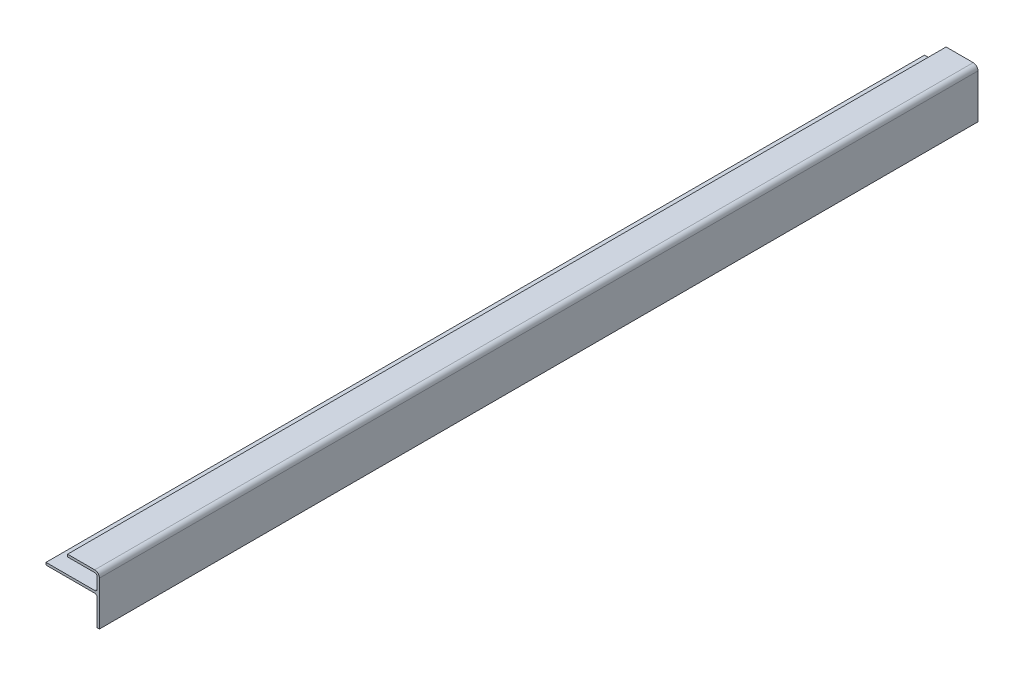
ISO-10303-21;
HEADER;
FILE_DESCRIPTION(('STEP AP214'),'2;1');
FILE_NAME('part.step','',(''),(''),'','','');
FILE_SCHEMA(('AUTOMOTIVE_DESIGN { 1 0 10303 214 1 1 1 1 }'));
ENDSEC;
DATA;
#1=APPLICATION_CONTEXT('core data for automotive mechanical design processes');
#2=APPLICATION_PROTOCOL_DEFINITION('international standard','automotive_design',2000,#1);
#3=PRODUCT_CONTEXT('',#1,'mechanical');
#4=PRODUCT('Part','Part','',(#3));
#5=PRODUCT_RELATED_PRODUCT_CATEGORY('part','',(#4));
#6=PRODUCT_DEFINITION_FORMATION('','',#4);
#7=PRODUCT_DEFINITION_CONTEXT('part definition',#1,'design');
#8=PRODUCT_DEFINITION('design','',#6,#7);
#9=PRODUCT_DEFINITION_SHAPE('','',#8);
#10=(LENGTH_UNIT() NAMED_UNIT(*) SI_UNIT(.MILLI.,.METRE.));
#11=(NAMED_UNIT(*) PLANE_ANGLE_UNIT() SI_UNIT($,.RADIAN.));
#12=(NAMED_UNIT(*) SI_UNIT($,.STERADIAN.) SOLID_ANGLE_UNIT());
#13=UNCERTAINTY_MEASURE_WITH_UNIT(LENGTH_MEASURE(1.E-05),#10,'distance_accuracy_value','');
#14=(GEOMETRIC_REPRESENTATION_CONTEXT(3) GLOBAL_UNCERTAINTY_ASSIGNED_CONTEXT((#13)) GLOBAL_UNIT_ASSIGNED_CONTEXT((#10,
#11,#12)) REPRESENTATION_CONTEXT('',''));
#15=CARTESIAN_POINT('',(0.,0.,0.));
#16=DIRECTION('',(0.,0.,1.));
#17=DIRECTION('',(1.,0.,0.));
#18=AXIS2_PLACEMENT_3D('',#15,#16,#17);
#19=CARTESIAN_POINT('',(1217.6125,36.5125,292.1));
#20=DIRECTION('',(0.,0.,-1.));
#21=DIRECTION('',(-1.,0.,0.));
#22=AXIS2_PLACEMENT_3D('',#19,#20,#21);
#23=CYLINDRICAL_SURFACE('',#22,1.58749999999993);
#24=CARTESIAN_POINT('',(1217.6125,36.5125,-292.1));
#25=DIRECTION('',(0.,0.,-1.));
#26=DIRECTION('',(1.,0.,0.));
#27=AXIS2_PLACEMENT_3D('',#24,#25,#26);
#28=CIRCLE('',#27,1.58749999999993);
#29=CARTESIAN_POINT('',(1217.6125,38.1,-292.1));
#30=VERTEX_POINT('',#29);
#31=CARTESIAN_POINT('',(1219.2,36.5125,-292.1));
#32=VERTEX_POINT('',#31);
#33=EDGE_CURVE('E163',#30,#32,#28,.T.);
#34=ORIENTED_EDGE('',*,*,#33,.T.);
#35=DIRECTION('',(0.,0.,-1.));
#36=VECTOR('',#35,1.);
#37=CARTESIAN_POINT('',(1219.2,36.5125,292.1));
#38=LINE('',#37,#36);
#39=CARTESIAN_POINT('',(1219.2,36.5125,292.1));
#40=VERTEX_POINT('',#39);
#41=EDGE_CURVE('E11',#40,#32,#38,.T.);
#42=ORIENTED_EDGE('',*,*,#41,.F.);
#43=CARTESIAN_POINT('',(1217.6125,36.5125,292.1));
#44=DIRECTION('',(0.,0.,-1.));
#45=DIRECTION('',(1.,0.,0.));
#46=AXIS2_PLACEMENT_3D('',#43,#44,#45);
#47=CIRCLE('',#46,1.58749999999993);
#48=CARTESIAN_POINT('',(1217.6125,38.1,292.1));
#49=VERTEX_POINT('',#48);
#50=EDGE_CURVE('E189',#49,#40,#47,.T.);
#51=ORIENTED_EDGE('',*,*,#50,.F.);
#52=DIRECTION('',(0.,0.,-1.));
#53=VECTOR('',#52,1.);
#54=CARTESIAN_POINT('',(1217.6125,38.1,292.1));
#55=LINE('',#54,#53);
#56=EDGE_CURVE('E159',#49,#30,#55,.T.);
#57=ORIENTED_EDGE('',*,*,#56,.T.);
#58=EDGE_LOOP('',(#34,#42,#51,#57));
#59=FACE_BOUND('',#58,.T.);
#60=ADVANCED_FACE('F31',(#59),#23,.F.);
#61=CARTESIAN_POINT('',(1219.2,19.05,292.1));
#62=DIRECTION('',(1.,0.,0.));
#63=DIRECTION('',(0.,0.,-1.));
#64=AXIS2_PLACEMENT_3D('',#61,#62,#63);
#65=PLANE('',#64);
#66=DIRECTION('',(0.,-1.,0.));
#67=VECTOR('',#66,1.);
#68=CARTESIAN_POINT('',(1219.2,19.05,-292.1));
#69=LINE('',#68,#67);
#70=CARTESIAN_POINT('',(1219.2,19.05,-292.1));
#71=VERTEX_POINT('',#70);
#72=EDGE_CURVE('E166',#32,#71,#69,.T.);
#73=ORIENTED_EDGE('',*,*,#72,.T.);
#74=DIRECTION('',(0.,0.,-1.));
#75=VECTOR('',#74,1.);
#76=CARTESIAN_POINT('',(1219.2,19.05,292.1));
#77=LINE('',#76,#75);
#78=CARTESIAN_POINT('',(1219.2,19.05,292.1));
#79=VERTEX_POINT('',#78);
#80=EDGE_CURVE('E39',#79,#71,#77,.T.);
#81=ORIENTED_EDGE('',*,*,#80,.F.);
#82=DIRECTION('',(0.,-1.,0.));
#83=VECTOR('',#82,1.);
#84=CARTESIAN_POINT('',(1219.2,19.05,292.1));
#85=LINE('',#84,#83);
#86=EDGE_CURVE('E108',#40,#79,#85,.T.);
#87=ORIENTED_EDGE('',*,*,#86,.F.);
#88=ORIENTED_EDGE('',*,*,#41,.T.);
#89=EDGE_LOOP('',(#73,#81,#87,#88));
#90=FACE_BOUND('',#89,.T.);
#91=ADVANCED_FACE('F277',(#90),#65,.F.);
#92=CARTESIAN_POINT('',(1219.2,19.05,292.1));
#93=DIRECTION('',(0.,1.,0.));
#94=DIRECTION('',(0.,0.,1.));
#95=AXIS2_PLACEMENT_3D('',#92,#93,#94);
#96=PLANE('',#95);
#97=DIRECTION('',(1.,0.,0.));
#98=VECTOR('',#97,1.);
#99=CARTESIAN_POINT('',(1219.2,19.05,-292.1));
#100=LINE('',#99,#98);
#101=CARTESIAN_POINT('',(1220.7875,19.05,-292.1));
#102=VERTEX_POINT('',#101);
#103=EDGE_CURVE('E168',#71,#102,#100,.T.);
#104=ORIENTED_EDGE('',*,*,#103,.T.);
#105=DIRECTION('',(0.,0.,-1.));
#106=VECTOR('',#105,1.);
#107=CARTESIAN_POINT('',(1220.7875,19.05,292.1));
#108=LINE('',#107,#106);
#109=CARTESIAN_POINT('',(1220.7875,19.05,292.1));
#110=VERTEX_POINT('',#109);
#111=EDGE_CURVE('E214',#110,#102,#108,.T.);
#112=ORIENTED_EDGE('',*,*,#111,.F.);
#113=DIRECTION('',(1.,0.,0.));
#114=VECTOR('',#113,1.);
#115=CARTESIAN_POINT('',(1219.2,19.05,292.1));
#116=LINE('',#115,#114);
#117=EDGE_CURVE('E222',#79,#110,#116,.T.);
#118=ORIENTED_EDGE('',*,*,#117,.F.);
#119=ORIENTED_EDGE('',*,*,#80,.T.);
#120=EDGE_LOOP('',(#104,#112,#118,#119));
#121=FACE_BOUND('',#120,.T.);
#122=ADVANCED_FACE('F220',(#121),#96,.F.);
#123=CARTESIAN_POINT('',(1220.7875,48.387,292.1));
#124=DIRECTION('',(-1.,0.,0.));
#125=DIRECTION('',(0.,0.,1.));
#126=AXIS2_PLACEMENT_3D('',#123,#124,#125);
#127=PLANE('',#126);
#128=DIRECTION('',(0.,1.,0.));
#129=VECTOR('',#128,1.);
#130=CARTESIAN_POINT('',(1220.7875,48.387,-292.1));
#131=LINE('',#130,#129);
#132=CARTESIAN_POINT('',(1220.7875,48.387,-292.1));
#133=VERTEX_POINT('',#132);
#134=EDGE_CURVE('E170',#102,#133,#131,.T.);
#135=ORIENTED_EDGE('',*,*,#134,.T.);
#136=DIRECTION('',(0.,0.,-1.));
#137=VECTOR('',#136,1.);
#138=CARTESIAN_POINT('',(1220.7875,48.387,292.1));
#139=LINE('',#138,#137);
#140=CARTESIAN_POINT('',(1220.7875,48.387,292.1));
#141=VERTEX_POINT('',#140);
#142=EDGE_CURVE('E211',#141,#133,#139,.T.);
#143=ORIENTED_EDGE('',*,*,#142,.F.);
#144=DIRECTION('',(0.,1.,0.));
#145=VECTOR('',#144,1.);
#146=CARTESIAN_POINT('',(1220.7875,48.387,292.1));
#147=LINE('',#146,#145);
#148=EDGE_CURVE('E240',#110,#141,#147,.T.);
#149=ORIENTED_EDGE('',*,*,#148,.F.);
#150=ORIENTED_EDGE('',*,*,#111,.T.);
#151=EDGE_LOOP('',(#135,#143,#149,#150));
#152=FACE_BOUND('',#151,.T.);
#153=ADVANCED_FACE('F231',(#152),#127,.F.);
#154=CARTESIAN_POINT('',(1217.6125,48.387,292.1));
#155=DIRECTION('',(0.,0.,-1.));
#156=DIRECTION('',(-1.,0.,0.));
#157=AXIS2_PLACEMENT_3D('',#154,#155,#156);
#158=CYLINDRICAL_SURFACE('',#157,3.17499999999997);
#159=CARTESIAN_POINT('',(1217.6125,48.387,-292.1));
#160=DIRECTION('',(0.,0.,1.));
#161=DIRECTION('',(1.,0.,0.));
#162=AXIS2_PLACEMENT_3D('',#159,#160,#161);
#163=CIRCLE('',#162,3.17499999999997);
#164=CARTESIAN_POINT('',(1217.6125,51.562,-292.1));
#165=VERTEX_POINT('',#164);
#166=EDGE_CURVE('E172',#133,#165,#163,.T.);
#167=ORIENTED_EDGE('',*,*,#166,.T.);
#168=DIRECTION('',(0.,0.,-1.));
#169=VECTOR('',#168,1.);
#170=CARTESIAN_POINT('',(1217.6125,51.562,292.1));
#171=LINE('',#170,#169);
#172=CARTESIAN_POINT('',(1217.6125,51.562,292.1));
#173=VERTEX_POINT('',#172);
#174=EDGE_CURVE('E208',#173,#165,#171,.T.);
#175=ORIENTED_EDGE('',*,*,#174,.F.);
#176=CARTESIAN_POINT('',(1217.6125,48.387,292.1));
#177=DIRECTION('',(0.,0.,1.));
#178=DIRECTION('',(1.,0.,0.));
#179=AXIS2_PLACEMENT_3D('',#176,#177,#178);
#180=CIRCLE('',#179,3.17499999999997);
#181=EDGE_CURVE('E237',#141,#173,#180,.T.);
#182=ORIENTED_EDGE('',*,*,#181,.F.);
#183=ORIENTED_EDGE('',*,*,#142,.T.);
#184=EDGE_LOOP('',(#167,#175,#182,#183));
#185=FACE_BOUND('',#184,.T.);
#186=ADVANCED_FACE('F235',(#185),#158,.T.);
#187=CARTESIAN_POINT('',(1217.6125,51.562,292.1));
#188=DIRECTION('',(0.,-1.,0.));
#189=DIRECTION('',(1.,0.,0.));
#190=AXIS2_PLACEMENT_3D('',#187,#188,#189);
#191=PLANE('',#190);
#192=DIRECTION('',(-1.,0.,0.));
#193=VECTOR('',#192,1.);
#194=CARTESIAN_POINT('',(1217.6125,51.562,-292.1));
#195=LINE('',#194,#193);
#196=CARTESIAN_POINT('',(1199.5785,51.562,-292.1));
#197=VERTEX_POINT('',#196);
#198=EDGE_CURVE('E174',#165,#197,#195,.T.);
#199=ORIENTED_EDGE('',*,*,#198,.T.);
#200=DIRECTION('',(0.,0.,-1.));
#201=VECTOR('',#200,1.);
#202=CARTESIAN_POINT('',(1199.5785,51.562,292.1));
#203=LINE('',#202,#201);
#204=CARTESIAN_POINT('',(1199.5785,51.562,292.1));
#205=VERTEX_POINT('',#204);
#206=EDGE_CURVE('E205',#205,#197,#203,.T.);
#207=ORIENTED_EDGE('',*,*,#206,.F.);
#208=DIRECTION('',(-1.,0.,0.));
#209=VECTOR('',#208,1.);
#210=CARTESIAN_POINT('',(1217.6125,51.562,292.1));
#211=LINE('',#210,#209);
#212=EDGE_CURVE('E239',#173,#205,#211,.T.);
#213=ORIENTED_EDGE('',*,*,#212,.F.);
#214=ORIENTED_EDGE('',*,*,#174,.T.);
#215=EDGE_LOOP('',(#199,#207,#213,#214));
#216=FACE_BOUND('',#215,.T.);
#217=ADVANCED_FACE('F290',(#216),#191,.F.);
#218=CARTESIAN_POINT('',(1199.5785,51.562,292.1));
#219=DIRECTION('',(1.,0.,0.));
#220=DIRECTION('',(0.,0.,-1.));
#221=AXIS2_PLACEMENT_3D('',#218,#219,#220);
#222=PLANE('',#221);
#223=DIRECTION('',(0.,-1.,0.));
#224=VECTOR('',#223,1.);
#225=CARTESIAN_POINT('',(1199.5785,51.562,-292.1));
#226=LINE('',#225,#224);
#227=CARTESIAN_POINT('',(1199.5785,49.9745,-292.1));
#228=VERTEX_POINT('',#227);
#229=EDGE_CURVE('E176',#197,#228,#226,.T.);
#230=ORIENTED_EDGE('',*,*,#229,.T.);
#231=DIRECTION('',(0.,0.,-1.));
#232=VECTOR('',#231,1.);
#233=CARTESIAN_POINT('',(1199.5785,49.9745,292.1));
#234=LINE('',#233,#232);
#235=CARTESIAN_POINT('',(1199.5785,49.9745,292.1));
#236=VERTEX_POINT('',#235);
#237=EDGE_CURVE('E202',#236,#228,#234,.T.);
#238=ORIENTED_EDGE('',*,*,#237,.F.);
#239=DIRECTION('',(0.,-1.,0.));
#240=VECTOR('',#239,1.);
#241=CARTESIAN_POINT('',(1199.5785,51.562,292.1));
#242=LINE('',#241,#240);
#243=EDGE_CURVE('E242',#205,#236,#242,.T.);
#244=ORIENTED_EDGE('',*,*,#243,.F.);
#245=ORIENTED_EDGE('',*,*,#206,.T.);
#246=EDGE_LOOP('',(#230,#238,#244,#245));
#247=FACE_BOUND('',#246,.T.);
#248=ADVANCED_FACE('F293',(#247),#222,.F.);
#249=CARTESIAN_POINT('',(1199.5785,49.9745,292.1));
#250=DIRECTION('',(0.,1.,0.));
#251=DIRECTION('',(0.,0.,1.));
#252=AXIS2_PLACEMENT_3D('',#249,#250,#251);
#253=PLANE('',#252);
#254=DIRECTION('',(1.,0.,0.));
#255=VECTOR('',#254,1.);
#256=CARTESIAN_POINT('',(1199.5785,49.9745,-292.1));
#257=LINE('',#256,#255);
#258=CARTESIAN_POINT('',(1217.6125,49.9745,-292.1));
#259=VERTEX_POINT('',#258);
#260=EDGE_CURVE('E178',#228,#259,#257,.T.);
#261=ORIENTED_EDGE('',*,*,#260,.T.);
#262=DIRECTION('',(0.,0.,-1.));
#263=VECTOR('',#262,1.);
#264=CARTESIAN_POINT('',(1217.6125,49.9745,292.1));
#265=LINE('',#264,#263);
#266=CARTESIAN_POINT('',(1217.6125,49.9745,292.1));
#267=VERTEX_POINT('',#266);
#268=EDGE_CURVE('E199',#267,#259,#265,.T.);
#269=ORIENTED_EDGE('',*,*,#268,.F.);
#270=DIRECTION('',(1.,0.,0.));
#271=VECTOR('',#270,1.);
#272=CARTESIAN_POINT('',(1199.5785,49.9745,292.1));
#273=LINE('',#272,#271);
#274=EDGE_CURVE('E248',#236,#267,#273,.T.);
#275=ORIENTED_EDGE('',*,*,#274,.F.);
#276=ORIENTED_EDGE('',*,*,#237,.T.);
#277=EDGE_LOOP('',(#261,#269,#275,#276));
#278=FACE_BOUND('',#277,.T.);
#279=ADVANCED_FACE('F297',(#278),#253,.F.);
#280=CARTESIAN_POINT('',(1217.6125,48.387,292.1));
#281=DIRECTION('',(0.,0.,-1.));
#282=DIRECTION('',(-1.,0.,0.));
#283=AXIS2_PLACEMENT_3D('',#280,#281,#282);
#284=CYLINDRICAL_SURFACE('',#283,1.58749999999993);
#285=CARTESIAN_POINT('',(1217.6125,48.387,-292.1));
#286=DIRECTION('',(0.,0.,-1.));
#287=DIRECTION('',(1.,0.,0.));
#288=AXIS2_PLACEMENT_3D('',#285,#286,#287);
#289=CIRCLE('',#288,1.58749999999993);
#290=CARTESIAN_POINT('',(1219.2,48.387,-292.1));
#291=VERTEX_POINT('',#290);
#292=EDGE_CURVE('E180',#259,#291,#289,.T.);
#293=ORIENTED_EDGE('',*,*,#292,.T.);
#294=DIRECTION('',(0.,0.,-1.));
#295=VECTOR('',#294,1.);
#296=CARTESIAN_POINT('',(1219.2,48.387,292.1));
#297=LINE('',#296,#295);
#298=CARTESIAN_POINT('',(1219.2,48.387,292.1));
#299=VERTEX_POINT('',#298);
#300=EDGE_CURVE('E196',#299,#291,#297,.T.);
#301=ORIENTED_EDGE('',*,*,#300,.F.);
#302=CARTESIAN_POINT('',(1217.6125,48.387,292.1));
#303=DIRECTION('',(0.,0.,-1.));
#304=DIRECTION('',(1.,0.,0.));
#305=AXIS2_PLACEMENT_3D('',#302,#303,#304);
#306=CIRCLE('',#305,1.58749999999993);
#307=EDGE_CURVE('E250',#267,#299,#306,.T.);
#308=ORIENTED_EDGE('',*,*,#307,.F.);
#309=ORIENTED_EDGE('',*,*,#268,.T.);
#310=EDGE_LOOP('',(#293,#301,#308,#309));
#311=FACE_BOUND('',#310,.T.);
#312=ADVANCED_FACE('F301',(#311),#284,.F.);
#313=CARTESIAN_POINT('',(1219.2,48.387,292.1));
#314=DIRECTION('',(1.,0.,0.));
#315=DIRECTION('',(0.,0.,-1.));
#316=AXIS2_PLACEMENT_3D('',#313,#314,#315);
#317=PLANE('',#316);
#318=DIRECTION('',(0.,-1.,0.));
#319=VECTOR('',#318,1.);
#320=CARTESIAN_POINT('',(1219.2,48.387,-292.1));
#321=LINE('',#320,#319);
#322=CARTESIAN_POINT('',(1219.2,41.275,-292.1));
#323=VERTEX_POINT('',#322);
#324=EDGE_CURVE('E182',#291,#323,#321,.T.);
#325=ORIENTED_EDGE('',*,*,#324,.T.);
#326=DIRECTION('',(0.,0.,-1.));
#327=VECTOR('',#326,1.);
#328=CARTESIAN_POINT('',(1219.2,41.275,292.1));
#329=LINE('',#328,#327);
#330=CARTESIAN_POINT('',(1219.2,41.275,292.1));
#331=VERTEX_POINT('',#330);
#332=EDGE_CURVE('E193',#331,#323,#329,.T.);
#333=ORIENTED_EDGE('',*,*,#332,.F.);
#334=DIRECTION('',(0.,-1.,0.));
#335=VECTOR('',#334,1.);
#336=CARTESIAN_POINT('',(1219.2,48.387,292.1));
#337=LINE('',#336,#335);
#338=EDGE_CURVE('E252',#299,#331,#337,.T.);
#339=ORIENTED_EDGE('',*,*,#338,.F.);
#340=ORIENTED_EDGE('',*,*,#300,.T.);
#341=EDGE_LOOP('',(#325,#333,#339,#340));
#342=FACE_BOUND('',#341,.T.);
#343=ADVANCED_FACE('F258',(#342),#317,.F.);
#344=CARTESIAN_POINT('',(1217.6125,41.275,292.1));
#345=DIRECTION('',(0.,0.,-1.));
#346=DIRECTION('',(-1.,0.,0.));
#347=AXIS2_PLACEMENT_3D('',#344,#345,#346);
#348=CYLINDRICAL_SURFACE('',#347,1.58749999999993);
#349=CARTESIAN_POINT('',(1217.6125,41.275,-292.1));
#350=DIRECTION('',(0.,0.,-1.));
#351=DIRECTION('',(1.,0.,0.));
#352=AXIS2_PLACEMENT_3D('',#349,#350,#351);
#353=CIRCLE('',#352,1.58749999999993);
#354=CARTESIAN_POINT('',(1217.6125,39.6875000000001,-292.1));
#355=VERTEX_POINT('',#354);
#356=EDGE_CURVE('E184',#323,#355,#353,.T.);
#357=ORIENTED_EDGE('',*,*,#356,.T.);
#358=DIRECTION('',(0.,0.,-1.));
#359=VECTOR('',#358,1.);
#360=CARTESIAN_POINT('',(1217.6125,39.6875000000001,292.1));
#361=LINE('',#360,#359);
#362=CARTESIAN_POINT('',(1217.6125,39.6875000000001,292.1));
#363=VERTEX_POINT('',#362);
#364=EDGE_CURVE('E154',#363,#355,#361,.T.);
#365=ORIENTED_EDGE('',*,*,#364,.F.);
#366=CARTESIAN_POINT('',(1217.6125,41.275,292.1));
#367=DIRECTION('',(0.,0.,-1.));
#368=DIRECTION('',(1.,0.,0.));
#369=AXIS2_PLACEMENT_3D('',#366,#367,#368);
#370=CIRCLE('',#369,1.58749999999993);
#371=EDGE_CURVE('E145',#331,#363,#370,.T.);
#372=ORIENTED_EDGE('',*,*,#371,.F.);
#373=ORIENTED_EDGE('',*,*,#332,.T.);
#374=EDGE_LOOP('',(#357,#365,#372,#373));
#375=FACE_BOUND('',#374,.T.);
#376=ADVANCED_FACE('F262',(#375),#348,.F.);
#377=CARTESIAN_POINT('',(1185.2275,39.6875,292.1));
#378=DIRECTION('',(0.,-1.,0.));
#379=DIRECTION('',(0.,0.,-1.));
#380=AXIS2_PLACEMENT_3D('',#377,#378,#379);
#381=PLANE('',#380);
#382=DIRECTION('',(-1.,0.,0.));
#383=VECTOR('',#382,1.);
#384=CARTESIAN_POINT('',(1185.2275,39.6875,-292.1));
#385=LINE('',#384,#383);
#386=CARTESIAN_POINT('',(1185.2275,39.6875,-292.1));
#387=VERTEX_POINT('',#386);
#388=EDGE_CURVE('E153',#355,#387,#385,.T.);
#389=ORIENTED_EDGE('',*,*,#388,.T.);
#390=DIRECTION('',(0.,0.,-1.));
#391=VECTOR('',#390,1.);
#392=CARTESIAN_POINT('',(1185.2275,39.6875,292.1));
#393=LINE('',#392,#391);
#394=CARTESIAN_POINT('',(1185.2275,39.6875,292.1));
#395=VERTEX_POINT('',#394);
#396=EDGE_CURVE('E150',#395,#387,#393,.T.);
#397=ORIENTED_EDGE('',*,*,#396,.F.);
#398=DIRECTION('',(-1.,0.,0.));
#399=VECTOR('',#398,1.);
#400=CARTESIAN_POINT('',(1185.2275,39.6875,292.1));
#401=LINE('',#400,#399);
#402=EDGE_CURVE('E139',#363,#395,#401,.T.);
#403=ORIENTED_EDGE('',*,*,#402,.F.);
#404=ORIENTED_EDGE('',*,*,#364,.T.);
#405=EDGE_LOOP('',(#389,#397,#403,#404));
#406=FACE_BOUND('',#405,.T.);
#407=ADVANCED_FACE('F151',(#406),#381,.F.);
#408=CARTESIAN_POINT('',(1185.2275,38.1,292.1));
#409=DIRECTION('',(1.,0.,0.));
#410=DIRECTION('',(0.,0.,-1.));
#411=AXIS2_PLACEMENT_3D('',#408,#409,#410);
#412=PLANE('',#411);
#413=DIRECTION('',(0.,-1.,0.));
#414=VECTOR('',#413,1.);
#415=CARTESIAN_POINT('',(1185.2275,38.1,-292.1));
#416=LINE('',#415,#414);
#417=CARTESIAN_POINT('',(1185.2275,38.1,-292.1));
#418=VERTEX_POINT('',#417);
#419=EDGE_CURVE('E94',#387,#418,#416,.T.);
#420=ORIENTED_EDGE('',*,*,#419,.T.);
#421=DIRECTION('',(0.,0.,-1.));
#422=VECTOR('',#421,1.);
#423=CARTESIAN_POINT('',(1185.2275,38.1,292.1));
#424=LINE('',#423,#422);
#425=CARTESIAN_POINT('',(1185.2275,38.1,292.1));
#426=VERTEX_POINT('',#425);
#427=EDGE_CURVE('E155',#426,#418,#424,.T.);
#428=ORIENTED_EDGE('',*,*,#427,.F.);
#429=DIRECTION('',(0.,-1.,0.));
#430=VECTOR('',#429,1.);
#431=CARTESIAN_POINT('',(1185.2275,38.1,292.1));
#432=LINE('',#431,#430);
#433=EDGE_CURVE('E143',#395,#426,#432,.T.);
#434=ORIENTED_EDGE('',*,*,#433,.F.);
#435=ORIENTED_EDGE('',*,*,#396,.T.);
#436=EDGE_LOOP('',(#420,#428,#434,#435));
#437=FACE_BOUND('',#436,.T.);
#438=ADVANCED_FACE('F157',(#437),#412,.F.);
#439=CARTESIAN_POINT('',(1217.6125,38.1,292.1));
#440=DIRECTION('',(0.,1.,0.));
#441=DIRECTION('',(0.,0.,1.));
#442=AXIS2_PLACEMENT_3D('',#439,#440,#441);
#443=PLANE('',#442);
#444=DIRECTION('',(1.,0.,0.));
#445=VECTOR('',#444,1.);
#446=CARTESIAN_POINT('',(1217.6125,38.1,-292.1));
#447=LINE('',#446,#445);
#448=EDGE_CURVE('E100',#418,#30,#447,.T.);
#449=ORIENTED_EDGE('',*,*,#448,.T.);
#450=ORIENTED_EDGE('',*,*,#56,.F.);
#451=DIRECTION('',(1.,0.,0.));
#452=VECTOR('',#451,1.);
#453=CARTESIAN_POINT('',(1217.6125,38.1,292.1));
#454=LINE('',#453,#452);
#455=EDGE_CURVE('E47',#426,#49,#454,.T.);
#456=ORIENTED_EDGE('',*,*,#455,.F.);
#457=ORIENTED_EDGE('',*,*,#427,.T.);
#458=EDGE_LOOP('',(#449,#450,#456,#457));
#459=FACE_BOUND('',#458,.T.);
#460=ADVANCED_FACE('F266',(#459),#443,.F.);
#461=CARTESIAN_POINT('',(1217.6125,36.5125,292.1));
#462=DIRECTION('',(0.,0.,1.));
#463=DIRECTION('',(1.,0.,0.));
#464=AXIS2_PLACEMENT_3D('',#461,#462,#463);
#465=PLANE('',#464);
#466=ORIENTED_EDGE('',*,*,#50,.T.);
#467=ORIENTED_EDGE('',*,*,#86,.T.);
#468=ORIENTED_EDGE('',*,*,#117,.T.);
#469=ORIENTED_EDGE('',*,*,#148,.T.);
#470=ORIENTED_EDGE('',*,*,#181,.T.);
#471=ORIENTED_EDGE('',*,*,#212,.T.);
#472=ORIENTED_EDGE('',*,*,#243,.T.);
#473=ORIENTED_EDGE('',*,*,#274,.T.);
#474=ORIENTED_EDGE('',*,*,#307,.T.);
#475=ORIENTED_EDGE('',*,*,#338,.T.);
#476=ORIENTED_EDGE('',*,*,#371,.T.);
#477=ORIENTED_EDGE('',*,*,#402,.T.);
#478=ORIENTED_EDGE('',*,*,#433,.T.);
#479=ORIENTED_EDGE('',*,*,#455,.T.);
#480=EDGE_LOOP('',(#466,#467,#468,#469,#470,#471,#472,#473,#474,#475,#476,#477,#478,#479));
#481=FACE_BOUND('',#480,.T.);
#482=ADVANCED_FACE('F141',(#481),#465,.T.);
#483=CARTESIAN_POINT('',(1217.6125,36.5125,-292.1));
#484=DIRECTION('',(0.,0.,1.));
#485=DIRECTION('',(1.,0.,0.));
#486=AXIS2_PLACEMENT_3D('',#483,#484,#485);
#487=PLANE('',#486);
#488=ORIENTED_EDGE('',*,*,#33,.F.);
#489=ORIENTED_EDGE('',*,*,#448,.F.);
#490=ORIENTED_EDGE('',*,*,#419,.F.);
#491=ORIENTED_EDGE('',*,*,#388,.F.);
#492=ORIENTED_EDGE('',*,*,#356,.F.);
#493=ORIENTED_EDGE('',*,*,#324,.F.);
#494=ORIENTED_EDGE('',*,*,#292,.F.);
#495=ORIENTED_EDGE('',*,*,#260,.F.);
#496=ORIENTED_EDGE('',*,*,#229,.F.);
#497=ORIENTED_EDGE('',*,*,#198,.F.);
#498=ORIENTED_EDGE('',*,*,#166,.F.);
#499=ORIENTED_EDGE('',*,*,#134,.F.);
#500=ORIENTED_EDGE('',*,*,#103,.F.);
#501=ORIENTED_EDGE('',*,*,#72,.F.);
#502=EDGE_LOOP('',(#488,#489,#490,#491,#492,#493,#494,#495,#496,#497,#498,#499,#500,#501));
#503=FACE_BOUND('',#502,.T.);
#504=ADVANCED_FACE('F226',(#503),#487,.F.);
#505=CLOSED_SHELL('',(#60,#91,#122,#153,#186,#217,#248,#279,#312,#343,#376,#407,#438,#460,#482,#504));
#506=MANIFOLD_SOLID_BREP('B2',#505);
#507=ADVANCED_BREP_SHAPE_REPRESENTATION('',(#18,#506),#14);
#508=SHAPE_DEFINITION_REPRESENTATION(#9,#507);
ENDSEC;
END-ISO-10303-21;
